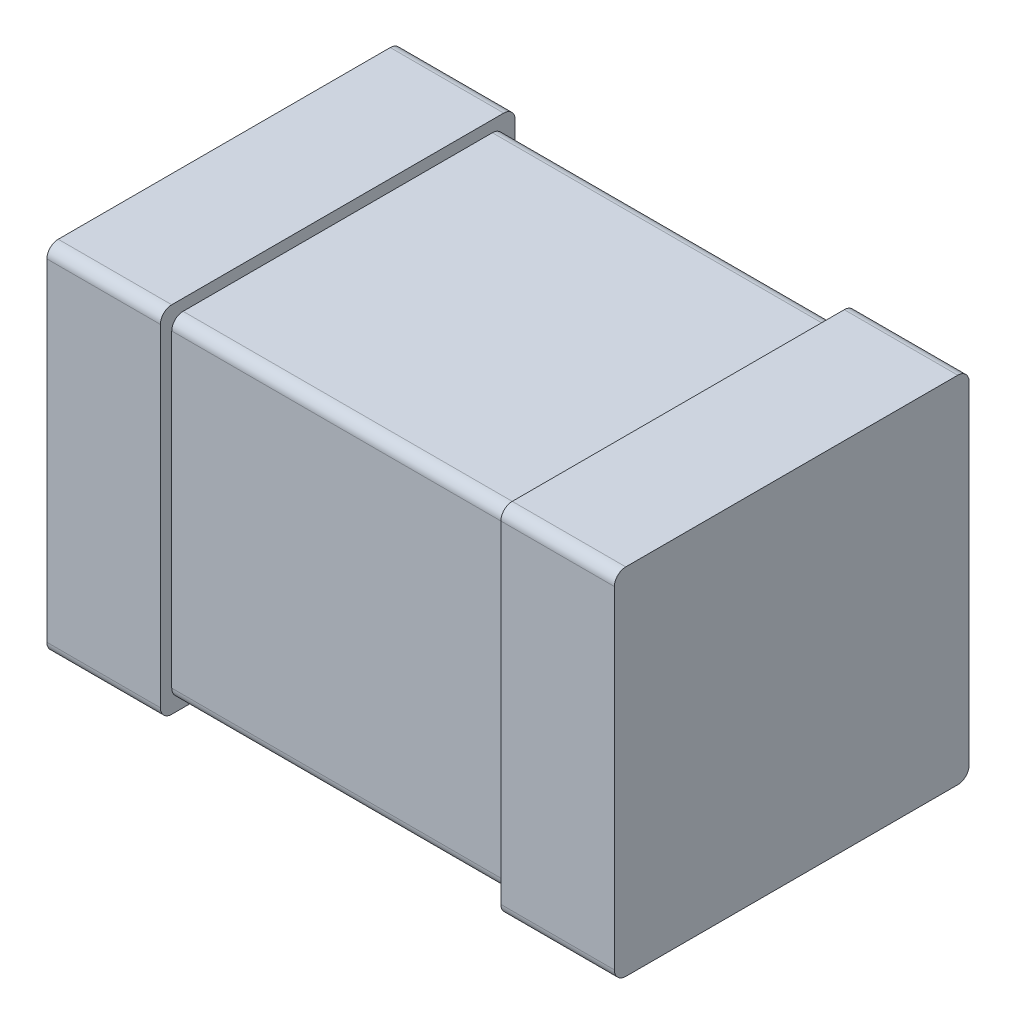
ISO-10303-21;
HEADER;
FILE_DESCRIPTION(('STEP AP214'),'2;1');
FILE_NAME('part.step','',(''),(''),'','','');
FILE_SCHEMA(('AUTOMOTIVE_DESIGN { 1 0 10303 214 1 1 1 1 }'));
ENDSEC;
DATA;
#1=APPLICATION_CONTEXT('core data for automotive mechanical design processes');
#2=APPLICATION_PROTOCOL_DEFINITION('international standard','automotive_design',2000,#1);
#3=PRODUCT_CONTEXT('',#1,'mechanical');
#4=PRODUCT('Part','Part','',(#3));
#5=PRODUCT_RELATED_PRODUCT_CATEGORY('part','',(#4));
#6=PRODUCT_DEFINITION_FORMATION('','',#4);
#7=PRODUCT_DEFINITION_CONTEXT('part definition',#1,'design');
#8=PRODUCT_DEFINITION('design','',#6,#7);
#9=PRODUCT_DEFINITION_SHAPE('','',#8);
#10=(LENGTH_UNIT() NAMED_UNIT(*) SI_UNIT(.MILLI.,.METRE.));
#11=(NAMED_UNIT(*) PLANE_ANGLE_UNIT() SI_UNIT($,.RADIAN.));
#12=(NAMED_UNIT(*) SI_UNIT($,.STERADIAN.) SOLID_ANGLE_UNIT());
#13=UNCERTAINTY_MEASURE_WITH_UNIT(LENGTH_MEASURE(1.E-05),#10,'distance_accuracy_value','');
#14=(GEOMETRIC_REPRESENTATION_CONTEXT(3) GLOBAL_UNCERTAINTY_ASSIGNED_CONTEXT((#13)) GLOBAL_UNIT_ASSIGNED_CONTEXT((#10,
#11,#12)) REPRESENTATION_CONTEXT('',''));
#15=CARTESIAN_POINT('',(0.,0.,0.));
#16=DIRECTION('',(0.,0.,1.));
#17=DIRECTION('',(1.,0.,0.));
#18=AXIS2_PLACEMENT_3D('',#15,#16,#17);
#19=CARTESIAN_POINT('',(1.,-0.625,0.));
#20=DIRECTION('',(1.,0.,0.));
#21=DIRECTION('',(0.,1.,0.));
#22=AXIS2_PLACEMENT_3D('',#19,#20,#21);
#23=PLANE('',#22);
#24=DIRECTION('',(0.,0.,1.));
#25=VECTOR('',#24,1.);
#26=CARTESIAN_POINT('',(1.,-0.625,0.));
#27=LINE('',#26,#25);
#28=CARTESIAN_POINT('',(1.,-0.625,0.04));
#29=VERTEX_POINT('',#28);
#30=CARTESIAN_POINT('',(1.,-0.625,1.21));
#31=VERTEX_POINT('',#30);
#32=EDGE_CURVE('E439',#29,#31,#27,.T.);
#33=ORIENTED_EDGE('',*,*,#32,.F.);
#34=CARTESIAN_POINT('',(1.,-0.585,0.04));
#35=DIRECTION('',(1.,0.,0.));
#36=DIRECTION('',(0.,0.,1.));
#37=AXIS2_PLACEMENT_3D('',#34,#35,#36);
#38=CIRCLE('',#37,0.04);
#39=CARTESIAN_POINT('',(1.,-0.585,0.));
#40=VERTEX_POINT('',#39);
#41=EDGE_CURVE('E250',#29,#40,#38,.T.);
#42=ORIENTED_EDGE('',*,*,#41,.T.);
#43=DIRECTION('',(0.,1.,0.));
#44=VECTOR('',#43,1.);
#45=CARTESIAN_POINT('',(1.,-0.625,0.));
#46=LINE('',#45,#44);
#47=CARTESIAN_POINT('',(1.,0.585,0.));
#48=VERTEX_POINT('',#47);
#49=EDGE_CURVE('E237',#40,#48,#46,.T.);
#50=ORIENTED_EDGE('',*,*,#49,.T.);
#51=CARTESIAN_POINT('',(1.,0.585,0.04));
#52=DIRECTION('',(-1.,0.,0.));
#53=DIRECTION('',(0.,0.,1.));
#54=AXIS2_PLACEMENT_3D('',#51,#52,#53);
#55=CIRCLE('',#54,0.04);
#56=CARTESIAN_POINT('',(1.,0.625,0.04));
#57=VERTEX_POINT('',#56);
#58=EDGE_CURVE('E289',#57,#48,#55,.T.);
#59=ORIENTED_EDGE('',*,*,#58,.F.);
#60=DIRECTION('',(0.,0.,1.));
#61=VECTOR('',#60,1.);
#62=CARTESIAN_POINT('',(1.,0.625,0.));
#63=LINE('',#62,#61);
#64=CARTESIAN_POINT('',(1.,0.625,1.21));
#65=VERTEX_POINT('',#64);
#66=EDGE_CURVE('E11',#57,#65,#63,.T.);
#67=ORIENTED_EDGE('',*,*,#66,.T.);
#68=CARTESIAN_POINT('',(1.,0.585,1.21));
#69=DIRECTION('',(1.,0.,0.));
#70=DIRECTION('',(0.,0.,1.));
#71=AXIS2_PLACEMENT_3D('',#68,#69,#70);
#72=CIRCLE('',#71,0.04);
#73=CARTESIAN_POINT('',(1.,0.585,1.25));
#74=VERTEX_POINT('',#73);
#75=EDGE_CURVE('E235',#65,#74,#72,.T.);
#76=ORIENTED_EDGE('',*,*,#75,.T.);
#77=DIRECTION('',(0.,1.,0.));
#78=VECTOR('',#77,1.);
#79=CARTESIAN_POINT('',(1.,-0.625,1.25));
#80=LINE('',#79,#78);
#81=CARTESIAN_POINT('',(1.,-0.585,1.25));
#82=VERTEX_POINT('',#81);
#83=EDGE_CURVE('E230',#82,#74,#80,.T.);
#84=ORIENTED_EDGE('',*,*,#83,.F.);
#85=CARTESIAN_POINT('',(1.,-0.585,1.21));
#86=DIRECTION('',(-1.,0.,0.));
#87=DIRECTION('',(0.,0.,1.));
#88=AXIS2_PLACEMENT_3D('',#85,#86,#87);
#89=CIRCLE('',#88,0.04);
#90=EDGE_CURVE('E232',#31,#82,#89,.T.);
#91=ORIENTED_EDGE('',*,*,#90,.F.);
#92=EDGE_LOOP('',(#33,#42,#50,#59,#67,#76,#84,#91));
#93=FACE_BOUND('',#92,.T.);
#94=ADVANCED_FACE('F19',(#93),#23,.T.);
#95=CARTESIAN_POINT('',(0.6,0.625,0.));
#96=DIRECTION('',(0.,1.,0.));
#97=DIRECTION('',(1.,0.,0.));
#98=AXIS2_PLACEMENT_3D('',#95,#96,#97);
#99=PLANE('',#98);
#100=ORIENTED_EDGE('',*,*,#66,.F.);
#101=DIRECTION('',(1.,0.,0.));
#102=VECTOR('',#101,1.);
#103=CARTESIAN_POINT('',(0.6,0.625,0.04));
#104=LINE('',#103,#102);
#105=CARTESIAN_POINT('',(0.6,0.625,0.04));
#106=VERTEX_POINT('',#105);
#107=EDGE_CURVE('E292',#106,#57,#104,.T.);
#108=ORIENTED_EDGE('',*,*,#107,.F.);
#109=DIRECTION('',(0.,0.,1.));
#110=VECTOR('',#109,1.);
#111=CARTESIAN_POINT('',(0.6,0.625,0.));
#112=LINE('',#111,#110);
#113=CARTESIAN_POINT('',(0.6,0.625,1.21));
#114=VERTEX_POINT('',#113);
#115=EDGE_CURVE('E269',#106,#114,#112,.T.);
#116=ORIENTED_EDGE('',*,*,#115,.T.);
#117=DIRECTION('',(1.,0.,0.));
#118=VECTOR('',#117,1.);
#119=CARTESIAN_POINT('',(0.6,0.625,1.21));
#120=LINE('',#119,#118);
#121=EDGE_CURVE('E30',#114,#65,#120,.T.);
#122=ORIENTED_EDGE('',*,*,#121,.T.);
#123=EDGE_LOOP('',(#100,#108,#116,#122));
#124=FACE_BOUND('',#123,.T.);
#125=ADVANCED_FACE('F888',(#124),#99,.T.);
#126=CARTESIAN_POINT('',(0.6,0.585,1.21));
#127=DIRECTION('',(1.,0.,0.));
#128=DIRECTION('',(0.,1.,0.));
#129=AXIS2_PLACEMENT_3D('',#126,#127,#128);
#130=CYLINDRICAL_SURFACE('',#129,0.04);
#131=CARTESIAN_POINT('',(0.6,0.585,1.21));
#132=DIRECTION('',(1.,0.,0.));
#133=DIRECTION('',(0.,0.,1.));
#134=AXIS2_PLACEMENT_3D('',#131,#132,#133);
#135=CIRCLE('',#134,0.04);
#136=CARTESIAN_POINT('',(0.6,0.585,1.25));
#137=VERTEX_POINT('',#136);
#138=EDGE_CURVE('E262',#114,#137,#135,.T.);
#139=ORIENTED_EDGE('',*,*,#138,.T.);
#140=DIRECTION('',(1.,0.,0.));
#141=VECTOR('',#140,1.);
#142=CARTESIAN_POINT('',(0.6,0.585,1.25));
#143=LINE('',#142,#141);
#144=EDGE_CURVE('E208',#137,#74,#143,.T.);
#145=ORIENTED_EDGE('',*,*,#144,.T.);
#146=ORIENTED_EDGE('',*,*,#75,.F.);
#147=ORIENTED_EDGE('',*,*,#121,.F.);
#148=EDGE_LOOP('',(#139,#145,#146,#147));
#149=FACE_BOUND('',#148,.T.);
#150=ADVANCED_FACE('F879',(#149),#130,.T.);
#151=CARTESIAN_POINT('',(0.6,0.585,0.04));
#152=DIRECTION('',(1.,0.,0.));
#153=DIRECTION('',(0.,1.,0.));
#154=AXIS2_PLACEMENT_3D('',#151,#152,#153);
#155=CYLINDRICAL_SURFACE('',#154,0.04);
#156=ORIENTED_EDGE('',*,*,#107,.T.);
#157=ORIENTED_EDGE('',*,*,#58,.T.);
#158=DIRECTION('',(1.,0.,0.));
#159=VECTOR('',#158,1.);
#160=CARTESIAN_POINT('',(0.6,0.585,0.));
#161=LINE('',#160,#159);
#162=CARTESIAN_POINT('',(0.6,0.585,0.));
#163=VERTEX_POINT('',#162);
#164=EDGE_CURVE('E244',#163,#48,#161,.T.);
#165=ORIENTED_EDGE('',*,*,#164,.F.);
#166=CARTESIAN_POINT('',(0.6,0.585,0.04));
#167=DIRECTION('',(-1.,0.,0.));
#168=DIRECTION('',(0.,0.,1.));
#169=AXIS2_PLACEMENT_3D('',#166,#167,#168);
#170=CIRCLE('',#169,0.04);
#171=EDGE_CURVE('E285',#106,#163,#170,.T.);
#172=ORIENTED_EDGE('',*,*,#171,.F.);
#173=EDGE_LOOP('',(#156,#157,#165,#172));
#174=FACE_BOUND('',#173,.T.);
#175=ADVANCED_FACE('F776',(#174),#155,.T.);
#176=CARTESIAN_POINT('',(0.6,-0.625,1.25));
#177=DIRECTION('',(0.,0.,1.));
#178=DIRECTION('',(1.,0.,0.));
#179=AXIS2_PLACEMENT_3D('',#176,#177,#178);
#180=PLANE('',#179);
#181=DIRECTION('',(0.,1.,0.));
#182=VECTOR('',#181,1.);
#183=CARTESIAN_POINT('',(0.6,-0.625,1.25));
#184=LINE('',#183,#182);
#185=CARTESIAN_POINT('',(0.6,-0.585,1.25));
#186=VERTEX_POINT('',#185);
#187=EDGE_CURVE('E241',#186,#137,#184,.T.);
#188=ORIENTED_EDGE('',*,*,#187,.F.);
#189=DIRECTION('',(1.,0.,0.));
#190=VECTOR('',#189,1.);
#191=CARTESIAN_POINT('',(0.6,-0.585,1.25));
#192=LINE('',#191,#190);
#193=EDGE_CURVE('E197',#186,#82,#192,.T.);
#194=ORIENTED_EDGE('',*,*,#193,.T.);
#195=ORIENTED_EDGE('',*,*,#83,.T.);
#196=ORIENTED_EDGE('',*,*,#144,.F.);
#197=EDGE_LOOP('',(#188,#194,#195,#196));
#198=FACE_BOUND('',#197,.T.);
#199=ADVANCED_FACE('F239',(#198),#180,.T.);
#200=CARTESIAN_POINT('',(0.6,-0.625,0.));
#201=DIRECTION('',(0.,0.,1.));
#202=DIRECTION('',(1.,0.,0.));
#203=AXIS2_PLACEMENT_3D('',#200,#201,#202);
#204=PLANE('',#203);
#205=ORIENTED_EDGE('',*,*,#164,.T.);
#206=ORIENTED_EDGE('',*,*,#49,.F.);
#207=DIRECTION('',(1.,0.,0.));
#208=VECTOR('',#207,1.);
#209=CARTESIAN_POINT('',(0.6,-0.585,0.));
#210=LINE('',#209,#208);
#211=CARTESIAN_POINT('',(0.6,-0.585,0.));
#212=VERTEX_POINT('',#211);
#213=EDGE_CURVE('E257',#212,#40,#210,.T.);
#214=ORIENTED_EDGE('',*,*,#213,.F.);
#215=DIRECTION('',(0.,1.,0.));
#216=VECTOR('',#215,1.);
#217=CARTESIAN_POINT('',(0.6,-0.625,0.));
#218=LINE('',#217,#216);
#219=EDGE_CURVE('E288',#212,#163,#218,.T.);
#220=ORIENTED_EDGE('',*,*,#219,.T.);
#221=EDGE_LOOP('',(#205,#206,#214,#220));
#222=FACE_BOUND('',#221,.T.);
#223=ADVANCED_FACE('F775',(#222),#204,.F.);
#224=CARTESIAN_POINT('',(0.6,-0.585,1.21));
#225=DIRECTION('',(1.,0.,0.));
#226=DIRECTION('',(0.,-1.,0.));
#227=AXIS2_PLACEMENT_3D('',#224,#225,#226);
#228=CYLINDRICAL_SURFACE('',#227,0.04);
#229=DIRECTION('',(1.,0.,0.));
#230=VECTOR('',#229,1.);
#231=CARTESIAN_POINT('',(0.6,-0.625,1.21));
#232=LINE('',#231,#230);
#233=CARTESIAN_POINT('',(0.6,-0.625,1.21));
#234=VERTEX_POINT('',#233);
#235=EDGE_CURVE('E248',#234,#31,#232,.T.);
#236=ORIENTED_EDGE('',*,*,#235,.T.);
#237=ORIENTED_EDGE('',*,*,#90,.T.);
#238=ORIENTED_EDGE('',*,*,#193,.F.);
#239=CARTESIAN_POINT('',(0.6,-0.585,1.21));
#240=DIRECTION('',(-1.,0.,0.));
#241=DIRECTION('',(0.,0.,1.));
#242=AXIS2_PLACEMENT_3D('',#239,#240,#241);
#243=CIRCLE('',#242,0.04);
#244=EDGE_CURVE('E263',#234,#186,#243,.T.);
#245=ORIENTED_EDGE('',*,*,#244,.F.);
#246=EDGE_LOOP('',(#236,#237,#238,#245));
#247=FACE_BOUND('',#246,.T.);
#248=ADVANCED_FACE('F247',(#247),#228,.T.);
#249=CARTESIAN_POINT('',(0.6,-0.585,0.04));
#250=DIRECTION('',(1.,0.,0.));
#251=DIRECTION('',(0.,-1.,0.));
#252=AXIS2_PLACEMENT_3D('',#249,#250,#251);
#253=CYLINDRICAL_SURFACE('',#252,0.04);
#254=CARTESIAN_POINT('',(0.6,-0.585,0.04));
#255=DIRECTION('',(1.,0.,0.));
#256=DIRECTION('',(0.,0.,1.));
#257=AXIS2_PLACEMENT_3D('',#254,#255,#256);
#258=CIRCLE('',#257,0.04);
#259=CARTESIAN_POINT('',(0.6,-0.625,0.04));
#260=VERTEX_POINT('',#259);
#261=EDGE_CURVE('E313',#260,#212,#258,.T.);
#262=ORIENTED_EDGE('',*,*,#261,.T.);
#263=ORIENTED_EDGE('',*,*,#213,.T.);
#264=ORIENTED_EDGE('',*,*,#41,.F.);
#265=DIRECTION('',(1.,0.,0.));
#266=VECTOR('',#265,1.);
#267=CARTESIAN_POINT('',(0.6,-0.625,0.04));
#268=LINE('',#267,#266);
#269=EDGE_CURVE('E355',#260,#29,#268,.T.);
#270=ORIENTED_EDGE('',*,*,#269,.F.);
#271=EDGE_LOOP('',(#262,#263,#264,#270));
#272=FACE_BOUND('',#271,.T.);
#273=ADVANCED_FACE('F838',(#272),#253,.T.);
#274=CARTESIAN_POINT('',(0.6,-0.625,0.));
#275=DIRECTION('',(0.,1.,0.));
#276=DIRECTION('',(1.,0.,0.));
#277=AXIS2_PLACEMENT_3D('',#274,#275,#276);
#278=PLANE('',#277);
#279=ORIENTED_EDGE('',*,*,#235,.F.);
#280=DIRECTION('',(0.,0.,1.));
#281=VECTOR('',#280,1.);
#282=CARTESIAN_POINT('',(0.6,-0.625,0.));
#283=LINE('',#282,#281);
#284=EDGE_CURVE('E310',#260,#234,#283,.T.);
#285=ORIENTED_EDGE('',*,*,#284,.F.);
#286=ORIENTED_EDGE('',*,*,#269,.T.);
#287=ORIENTED_EDGE('',*,*,#32,.T.);
#288=EDGE_LOOP('',(#279,#285,#286,#287));
#289=FACE_BOUND('',#288,.T.);
#290=ADVANCED_FACE('F764',(#289),#278,.F.);
#291=CARTESIAN_POINT('',(0.6,-0.625,0.));
#292=DIRECTION('',(1.,0.,0.));
#293=DIRECTION('',(0.,1.,0.));
#294=AXIS2_PLACEMENT_3D('',#291,#292,#293);
#295=PLANE('',#294);
#296=DIRECTION('',(0.,1.,0.));
#297=VECTOR('',#296,1.);
#298=CARTESIAN_POINT('',(0.6,-0.585,0.04));
#299=LINE('',#298,#297);
#300=CARTESIAN_POINT('',(0.6,-0.545,0.04));
#301=VERTEX_POINT('',#300);
#302=CARTESIAN_POINT('',(0.6,0.545,0.04));
#303=VERTEX_POINT('',#302);
#304=EDGE_CURVE('E320',#301,#303,#299,.T.);
#305=ORIENTED_EDGE('',*,*,#304,.T.);
#306=CARTESIAN_POINT('',(0.6,0.545,0.08));
#307=DIRECTION('',(-1.,0.,0.));
#308=DIRECTION('',(0.,0.,1.));
#309=AXIS2_PLACEMENT_3D('',#306,#307,#308);
#310=CIRCLE('',#309,0.04);
#311=CARTESIAN_POINT('',(0.6,0.585,0.08));
#312=VERTEX_POINT('',#311);
#313=EDGE_CURVE('E283',#312,#303,#310,.T.);
#314=ORIENTED_EDGE('',*,*,#313,.F.);
#315=DIRECTION('',(0.,0.,1.));
#316=VECTOR('',#315,1.);
#317=CARTESIAN_POINT('',(0.6,0.585,0.04));
#318=LINE('',#317,#316);
#319=CARTESIAN_POINT('',(0.6,0.585,1.17));
#320=VERTEX_POINT('',#319);
#321=EDGE_CURVE('E330',#312,#320,#318,.T.);
#322=ORIENTED_EDGE('',*,*,#321,.T.);
#323=CARTESIAN_POINT('',(0.6,0.545,1.17));
#324=DIRECTION('',(1.,0.,0.));
#325=DIRECTION('',(0.,0.,1.));
#326=AXIS2_PLACEMENT_3D('',#323,#324,#325);
#327=CIRCLE('',#326,0.04);
#328=CARTESIAN_POINT('',(0.6,0.545,1.21));
#329=VERTEX_POINT('',#328);
#330=EDGE_CURVE('E304',#320,#329,#327,.T.);
#331=ORIENTED_EDGE('',*,*,#330,.T.);
#332=DIRECTION('',(0.,1.,0.));
#333=VECTOR('',#332,1.);
#334=CARTESIAN_POINT('',(0.6,-0.585,1.21));
#335=LINE('',#334,#333);
#336=CARTESIAN_POINT('',(0.6,-0.545,1.21));
#337=VERTEX_POINT('',#336);
#338=EDGE_CURVE('E318',#337,#329,#335,.T.);
#339=ORIENTED_EDGE('',*,*,#338,.F.);
#340=CARTESIAN_POINT('',(0.6,-0.545,1.17));
#341=DIRECTION('',(-1.,0.,0.));
#342=DIRECTION('',(0.,0.,1.));
#343=AXIS2_PLACEMENT_3D('',#340,#341,#342);
#344=CIRCLE('',#343,0.04);
#345=CARTESIAN_POINT('',(0.6,-0.585,1.17));
#346=VERTEX_POINT('',#345);
#347=EDGE_CURVE('E279',#346,#337,#344,.T.);
#348=ORIENTED_EDGE('',*,*,#347,.F.);
#349=DIRECTION('',(0.,0.,1.));
#350=VECTOR('',#349,1.);
#351=CARTESIAN_POINT('',(0.6,-0.585,0.04));
#352=LINE('',#351,#350);
#353=CARTESIAN_POINT('',(0.6,-0.585,0.08));
#354=VERTEX_POINT('',#353);
#355=EDGE_CURVE('E272',#354,#346,#352,.T.);
#356=ORIENTED_EDGE('',*,*,#355,.F.);
#357=CARTESIAN_POINT('',(0.6,-0.545,0.08));
#358=DIRECTION('',(1.,0.,0.));
#359=DIRECTION('',(0.,0.,1.));
#360=AXIS2_PLACEMENT_3D('',#357,#358,#359);
#361=CIRCLE('',#360,0.04);
#362=EDGE_CURVE('E408',#354,#301,#361,.T.);
#363=ORIENTED_EDGE('',*,*,#362,.T.);
#364=EDGE_LOOP('',(#305,#314,#322,#331,#339,#348,#356,#363));
#365=FACE_BOUND('',#364,.T.);
#366=ORIENTED_EDGE('',*,*,#244,.T.);
#367=ORIENTED_EDGE('',*,*,#187,.T.);
#368=ORIENTED_EDGE('',*,*,#138,.F.);
#369=ORIENTED_EDGE('',*,*,#115,.F.);
#370=ORIENTED_EDGE('',*,*,#171,.T.);
#371=ORIENTED_EDGE('',*,*,#219,.F.);
#372=ORIENTED_EDGE('',*,*,#261,.F.);
#373=ORIENTED_EDGE('',*,*,#284,.T.);
#374=EDGE_LOOP('',(#366,#367,#368,#369,#370,#371,#372,#373));
#375=FACE_BOUND('',#374,.T.);
#376=ADVANCED_FACE('F599',(#365,#375),#295,.F.);
#377=CARTESIAN_POINT('',(-0.6,-0.585,0.04));
#378=DIRECTION('',(0.,1.,0.));
#379=DIRECTION('',(1.,0.,0.));
#380=AXIS2_PLACEMENT_3D('',#377,#378,#379);
#381=PLANE('',#380);
#382=DIRECTION('',(1.,0.,0.));
#383=VECTOR('',#382,1.);
#384=CARTESIAN_POINT('',(-0.6,-0.585,1.17));
#385=LINE('',#384,#383);
#386=CARTESIAN_POINT('',(-0.6,-0.585,1.17));
#387=VERTEX_POINT('',#386);
#388=EDGE_CURVE('E358',#387,#346,#385,.T.);
#389=ORIENTED_EDGE('',*,*,#388,.F.);
#390=DIRECTION('',(0.,0.,1.));
#391=VECTOR('',#390,1.);
#392=CARTESIAN_POINT('',(-0.6,-0.585,0.04));
#393=LINE('',#392,#391);
#394=CARTESIAN_POINT('',(-0.6,-0.585,0.08));
#395=VERTEX_POINT('',#394);
#396=EDGE_CURVE('E369',#395,#387,#393,.T.);
#397=ORIENTED_EDGE('',*,*,#396,.F.);
#398=DIRECTION('',(1.,0.,0.));
#399=VECTOR('',#398,1.);
#400=CARTESIAN_POINT('',(-0.6,-0.585,0.08));
#401=LINE('',#400,#399);
#402=EDGE_CURVE('E412',#395,#354,#401,.T.);
#403=ORIENTED_EDGE('',*,*,#402,.T.);
#404=ORIENTED_EDGE('',*,*,#355,.T.);
#405=EDGE_LOOP('',(#389,#397,#403,#404));
#406=FACE_BOUND('',#405,.T.);
#407=ADVANCED_FACE('F593',(#406),#381,.F.);
#408=CARTESIAN_POINT('',(-0.6,-0.545,1.17));
#409=DIRECTION('',(1.,0.,0.));
#410=DIRECTION('',(0.,-1.,0.));
#411=AXIS2_PLACEMENT_3D('',#408,#409,#410);
#412=CYLINDRICAL_SURFACE('',#411,0.04);
#413=ORIENTED_EDGE('',*,*,#388,.T.);
#414=ORIENTED_EDGE('',*,*,#347,.T.);
#415=DIRECTION('',(1.,0.,0.));
#416=VECTOR('',#415,1.);
#417=CARTESIAN_POINT('',(-0.6,-0.545,1.21));
#418=LINE('',#417,#416);
#419=CARTESIAN_POINT('',(-0.6,-0.545,1.21));
#420=VERTEX_POINT('',#419);
#421=EDGE_CURVE('E308',#420,#337,#418,.T.);
#422=ORIENTED_EDGE('',*,*,#421,.F.);
#423=CARTESIAN_POINT('',(-0.6,-0.545,1.17));
#424=DIRECTION('',(-1.,0.,0.));
#425=DIRECTION('',(0.,0.,1.));
#426=AXIS2_PLACEMENT_3D('',#423,#424,#425);
#427=CIRCLE('',#426,0.04);
#428=EDGE_CURVE('E347',#387,#420,#427,.T.);
#429=ORIENTED_EDGE('',*,*,#428,.F.);
#430=EDGE_LOOP('',(#413,#414,#422,#429));
#431=FACE_BOUND('',#430,.T.);
#432=ADVANCED_FACE('F598',(#431),#412,.T.);
#433=CARTESIAN_POINT('',(-0.6,-0.585,1.21));
#434=DIRECTION('',(0.,0.,1.));
#435=DIRECTION('',(1.,0.,0.));
#436=AXIS2_PLACEMENT_3D('',#433,#434,#435);
#437=PLANE('',#436);
#438=DIRECTION('',(0.,1.,0.));
#439=VECTOR('',#438,1.);
#440=CARTESIAN_POINT('',(-0.6,-0.585,1.21));
#441=LINE('',#440,#439);
#442=CARTESIAN_POINT('',(-0.6,0.545,1.21));
#443=VERTEX_POINT('',#442);
#444=EDGE_CURVE('E342',#420,#443,#441,.T.);
#445=ORIENTED_EDGE('',*,*,#444,.F.);
#446=ORIENTED_EDGE('',*,*,#421,.T.);
#447=ORIENTED_EDGE('',*,*,#338,.T.);
#448=DIRECTION('',(1.,0.,0.));
#449=VECTOR('',#448,1.);
#450=CARTESIAN_POINT('',(-0.6,0.545,1.21));
#451=LINE('',#450,#449);
#452=EDGE_CURVE('E309',#443,#329,#451,.T.);
#453=ORIENTED_EDGE('',*,*,#452,.F.);
#454=EDGE_LOOP('',(#445,#446,#447,#453));
#455=FACE_BOUND('',#454,.T.);
#456=ADVANCED_FACE('F614',(#455),#437,.T.);
#457=CARTESIAN_POINT('',(-0.6,0.545,1.17));
#458=DIRECTION('',(1.,0.,0.));
#459=DIRECTION('',(0.,1.,0.));
#460=AXIS2_PLACEMENT_3D('',#457,#458,#459);
#461=CYLINDRICAL_SURFACE('',#460,0.04);
#462=CARTESIAN_POINT('',(-0.6,0.545,1.17));
#463=DIRECTION('',(1.,0.,0.));
#464=DIRECTION('',(0.,0.,1.));
#465=AXIS2_PLACEMENT_3D('',#462,#463,#464);
#466=CIRCLE('',#465,0.04);
#467=CARTESIAN_POINT('',(-0.6,0.585,1.17));
#468=VERTEX_POINT('',#467);
#469=EDGE_CURVE('E346',#468,#443,#466,.T.);
#470=ORIENTED_EDGE('',*,*,#469,.T.);
#471=ORIENTED_EDGE('',*,*,#452,.T.);
#472=ORIENTED_EDGE('',*,*,#330,.F.);
#473=DIRECTION('',(1.,0.,0.));
#474=VECTOR('',#473,1.);
#475=CARTESIAN_POINT('',(-0.6,0.585,1.17));
#476=LINE('',#475,#474);
#477=EDGE_CURVE('E326',#468,#320,#476,.T.);
#478=ORIENTED_EDGE('',*,*,#477,.F.);
#479=EDGE_LOOP('',(#470,#471,#472,#478));
#480=FACE_BOUND('',#479,.T.);
#481=ADVANCED_FACE('F624',(#480),#461,.T.);
#482=CARTESIAN_POINT('',(-0.6,0.585,0.04));
#483=DIRECTION('',(0.,1.,0.));
#484=DIRECTION('',(1.,0.,0.));
#485=AXIS2_PLACEMENT_3D('',#482,#483,#484);
#486=PLANE('',#485);
#487=ORIENTED_EDGE('',*,*,#321,.F.);
#488=DIRECTION('',(1.,0.,0.));
#489=VECTOR('',#488,1.);
#490=CARTESIAN_POINT('',(-0.6,0.585,0.08));
#491=LINE('',#490,#489);
#492=CARTESIAN_POINT('',(-0.6,0.585,0.08));
#493=VERTEX_POINT('',#492);
#494=EDGE_CURVE('E324',#493,#312,#491,.T.);
#495=ORIENTED_EDGE('',*,*,#494,.F.);
#496=DIRECTION('',(0.,0.,1.));
#497=VECTOR('',#496,1.);
#498=CARTESIAN_POINT('',(-0.6,0.585,0.04));
#499=LINE('',#498,#497);
#500=EDGE_CURVE('E482',#493,#468,#499,.T.);
#501=ORIENTED_EDGE('',*,*,#500,.T.);
#502=ORIENTED_EDGE('',*,*,#477,.T.);
#503=EDGE_LOOP('',(#487,#495,#501,#502));
#504=FACE_BOUND('',#503,.T.);
#505=ADVANCED_FACE('F634',(#504),#486,.T.);
#506=CARTESIAN_POINT('',(-0.6,0.545,0.08));
#507=DIRECTION('',(1.,0.,0.));
#508=DIRECTION('',(0.,1.,0.));
#509=AXIS2_PLACEMENT_3D('',#506,#507,#508);
#510=CYLINDRICAL_SURFACE('',#509,0.04);
#511=ORIENTED_EDGE('',*,*,#494,.T.);
#512=ORIENTED_EDGE('',*,*,#313,.T.);
#513=DIRECTION('',(1.,0.,0.));
#514=VECTOR('',#513,1.);
#515=CARTESIAN_POINT('',(-0.6,0.545,0.04));
#516=LINE('',#515,#514);
#517=CARTESIAN_POINT('',(-0.6,0.545,0.04));
#518=VERTEX_POINT('',#517);
#519=EDGE_CURVE('E325',#518,#303,#516,.T.);
#520=ORIENTED_EDGE('',*,*,#519,.F.);
#521=CARTESIAN_POINT('',(-0.6,0.545,0.08));
#522=DIRECTION('',(-1.,0.,0.));
#523=DIRECTION('',(0.,0.,1.));
#524=AXIS2_PLACEMENT_3D('',#521,#522,#523);
#525=CIRCLE('',#524,0.04);
#526=EDGE_CURVE('E477',#493,#518,#525,.T.);
#527=ORIENTED_EDGE('',*,*,#526,.F.);
#528=EDGE_LOOP('',(#511,#512,#520,#527));
#529=FACE_BOUND('',#528,.T.);
#530=ADVANCED_FACE('F644',(#529),#510,.T.);
#531=CARTESIAN_POINT('',(-0.6,-0.585,0.04));
#532=DIRECTION('',(0.,0.,1.));
#533=DIRECTION('',(1.,0.,0.));
#534=AXIS2_PLACEMENT_3D('',#531,#532,#533);
#535=PLANE('',#534);
#536=ORIENTED_EDGE('',*,*,#519,.T.);
#537=ORIENTED_EDGE('',*,*,#304,.F.);
#538=DIRECTION('',(1.,0.,0.));
#539=VECTOR('',#538,1.);
#540=CARTESIAN_POINT('',(-0.6,-0.545,0.04));
#541=LINE('',#540,#539);
#542=CARTESIAN_POINT('',(-0.6,-0.545,0.04));
#543=VERTEX_POINT('',#542);
#544=EDGE_CURVE('E413',#543,#301,#541,.T.);
#545=ORIENTED_EDGE('',*,*,#544,.F.);
#546=DIRECTION('',(0.,1.,0.));
#547=VECTOR('',#546,1.);
#548=CARTESIAN_POINT('',(-0.6,-0.585,0.04));
#549=LINE('',#548,#547);
#550=EDGE_CURVE('E481',#543,#518,#549,.T.);
#551=ORIENTED_EDGE('',*,*,#550,.T.);
#552=EDGE_LOOP('',(#536,#537,#545,#551));
#553=FACE_BOUND('',#552,.T.);
#554=ADVANCED_FACE('F654',(#553),#535,.F.);
#555=CARTESIAN_POINT('',(-0.6,-0.545,0.08));
#556=DIRECTION('',(1.,0.,0.));
#557=DIRECTION('',(0.,-1.,0.));
#558=AXIS2_PLACEMENT_3D('',#555,#556,#557);
#559=CYLINDRICAL_SURFACE('',#558,0.04);
#560=CARTESIAN_POINT('',(-0.6,-0.545,0.08));
#561=DIRECTION('',(1.,0.,0.));
#562=DIRECTION('',(0.,0.,1.));
#563=AXIS2_PLACEMENT_3D('',#560,#561,#562);
#564=CIRCLE('',#563,0.04);
#565=EDGE_CURVE('E373',#395,#543,#564,.T.);
#566=ORIENTED_EDGE('',*,*,#565,.T.);
#567=ORIENTED_EDGE('',*,*,#544,.T.);
#568=ORIENTED_EDGE('',*,*,#362,.F.);
#569=ORIENTED_EDGE('',*,*,#402,.F.);
#570=EDGE_LOOP('',(#566,#567,#568,#569));
#571=FACE_BOUND('',#570,.T.);
#572=ADVANCED_FACE('F665',(#571),#559,.T.);
#573=CARTESIAN_POINT('',(-0.6,-0.625,0.));
#574=DIRECTION('',(1.,0.,0.));
#575=DIRECTION('',(0.,1.,0.));
#576=AXIS2_PLACEMENT_3D('',#573,#574,#575);
#577=PLANE('',#576);
#578=ORIENTED_EDGE('',*,*,#565,.F.);
#579=ORIENTED_EDGE('',*,*,#396,.T.);
#580=ORIENTED_EDGE('',*,*,#428,.T.);
#581=ORIENTED_EDGE('',*,*,#444,.T.);
#582=ORIENTED_EDGE('',*,*,#469,.F.);
#583=ORIENTED_EDGE('',*,*,#500,.F.);
#584=ORIENTED_EDGE('',*,*,#526,.T.);
#585=ORIENTED_EDGE('',*,*,#550,.F.);
#586=EDGE_LOOP('',(#578,#579,#580,#581,#582,#583,#584,#585));
#587=FACE_BOUND('',#586,.T.);
#588=DIRECTION('',(0.,0.,1.));
#589=VECTOR('',#588,1.);
#590=CARTESIAN_POINT('',(-0.6,-0.625,0.));
#591=LINE('',#590,#589);
#592=CARTESIAN_POINT('',(-0.6,-0.625,0.04));
#593=VERTEX_POINT('',#592);
#594=CARTESIAN_POINT('',(-0.6,-0.625,1.21));
#595=VERTEX_POINT('',#594);
#596=EDGE_CURVE('E260',#593,#595,#591,.T.);
#597=ORIENTED_EDGE('',*,*,#596,.F.);
#598=CARTESIAN_POINT('',(-0.6,-0.585,0.04));
#599=DIRECTION('',(1.,0.,0.));
#600=DIRECTION('',(0.,0.,1.));
#601=AXIS2_PLACEMENT_3D('',#598,#599,#600);
#602=CIRCLE('',#601,0.04);
#603=CARTESIAN_POINT('',(-0.6,-0.585,0.));
#604=VERTEX_POINT('',#603);
#605=EDGE_CURVE('E384',#593,#604,#602,.T.);
#606=ORIENTED_EDGE('',*,*,#605,.T.);
#607=DIRECTION('',(0.,1.,0.));
#608=VECTOR('',#607,1.);
#609=CARTESIAN_POINT('',(-0.6,-0.625,0.));
#610=LINE('',#609,#608);
#611=CARTESIAN_POINT('',(-0.6,0.585,0.));
#612=VERTEX_POINT('',#611);
#613=EDGE_CURVE('E392',#604,#612,#610,.T.);
#614=ORIENTED_EDGE('',*,*,#613,.T.);
#615=CARTESIAN_POINT('',(-0.6,0.585,0.04));
#616=DIRECTION('',(-1.,0.,0.));
#617=DIRECTION('',(0.,0.,1.));
#618=AXIS2_PLACEMENT_3D('',#615,#616,#617);
#619=CIRCLE('',#618,0.04);
#620=CARTESIAN_POINT('',(-0.6,0.625,0.04));
#621=VERTEX_POINT('',#620);
#622=EDGE_CURVE('E299',#621,#612,#619,.T.);
#623=ORIENTED_EDGE('',*,*,#622,.F.);
#624=DIRECTION('',(0.,0.,1.));
#625=VECTOR('',#624,1.);
#626=CARTESIAN_POINT('',(-0.6,0.625,0.));
#627=LINE('',#626,#625);
#628=CARTESIAN_POINT('',(-0.6,0.625,1.21));
#629=VERTEX_POINT('',#628);
#630=EDGE_CURVE('E396',#621,#629,#627,.T.);
#631=ORIENTED_EDGE('',*,*,#630,.T.);
#632=CARTESIAN_POINT('',(-0.6,0.585,1.21));
#633=DIRECTION('',(1.,0.,0.));
#634=DIRECTION('',(0.,0.,1.));
#635=AXIS2_PLACEMENT_3D('',#632,#633,#634);
#636=CIRCLE('',#635,0.04);
#637=CARTESIAN_POINT('',(-0.6,0.585,1.25));
#638=VERTEX_POINT('',#637);
#639=EDGE_CURVE('E302',#629,#638,#636,.T.);
#640=ORIENTED_EDGE('',*,*,#639,.T.);
#641=DIRECTION('',(0.,1.,0.));
#642=VECTOR('',#641,1.);
#643=CARTESIAN_POINT('',(-0.6,-0.625,1.25));
#644=LINE('',#643,#642);
#645=CARTESIAN_POINT('',(-0.6,-0.585,1.25));
#646=VERTEX_POINT('',#645);
#647=EDGE_CURVE('E469',#646,#638,#644,.T.);
#648=ORIENTED_EDGE('',*,*,#647,.F.);
#649=CARTESIAN_POINT('',(-0.6,-0.585,1.21));
#650=DIRECTION('',(-1.,0.,0.));
#651=DIRECTION('',(0.,0.,1.));
#652=AXIS2_PLACEMENT_3D('',#649,#650,#651);
#653=CIRCLE('',#652,0.04);
#654=EDGE_CURVE('E341',#595,#646,#653,.T.);
#655=ORIENTED_EDGE('',*,*,#654,.F.);
#656=EDGE_LOOP('',(#597,#606,#614,#623,#631,#640,#648,#655));
#657=FACE_BOUND('',#656,.T.);
#658=ADVANCED_FACE('F538',(#587,#657),#577,.T.);
#659=CARTESIAN_POINT('',(-1.,0.625,0.));
#660=DIRECTION('',(0.,1.,0.));
#661=DIRECTION('',(1.,0.,0.));
#662=AXIS2_PLACEMENT_3D('',#659,#660,#661);
#663=PLANE('',#662);
#664=ORIENTED_EDGE('',*,*,#630,.F.);
#665=DIRECTION('',(1.,0.,0.));
#666=VECTOR('',#665,1.);
#667=CARTESIAN_POINT('',(-1.,0.625,0.04));
#668=LINE('',#667,#666);
#669=CARTESIAN_POINT('',(-1.,0.625,0.04));
#670=VERTEX_POINT('',#669);
#671=EDGE_CURVE('E303',#670,#621,#668,.T.);
#672=ORIENTED_EDGE('',*,*,#671,.F.);
#673=DIRECTION('',(0.,0.,1.));
#674=VECTOR('',#673,1.);
#675=CARTESIAN_POINT('',(-1.,0.625,0.));
#676=LINE('',#675,#674);
#677=CARTESIAN_POINT('',(-1.,0.625,1.21));
#678=VERTEX_POINT('',#677);
#679=EDGE_CURVE('E352',#670,#678,#676,.T.);
#680=ORIENTED_EDGE('',*,*,#679,.T.);
#681=DIRECTION('',(1.,0.,0.));
#682=VECTOR('',#681,1.);
#683=CARTESIAN_POINT('',(-1.,0.625,1.21));
#684=LINE('',#683,#682);
#685=EDGE_CURVE('E422',#678,#629,#684,.T.);
#686=ORIENTED_EDGE('',*,*,#685,.T.);
#687=EDGE_LOOP('',(#664,#672,#680,#686));
#688=FACE_BOUND('',#687,.T.);
#689=ADVANCED_FACE('F21',(#688),#663,.T.);
#690=CARTESIAN_POINT('',(-1.,0.585,1.21));
#691=DIRECTION('',(1.,0.,0.));
#692=DIRECTION('',(0.,1.,0.));
#693=AXIS2_PLACEMENT_3D('',#690,#691,#692);
#694=CYLINDRICAL_SURFACE('',#693,0.04);
#695=CARTESIAN_POINT('',(-1.,0.585,1.21));
#696=DIRECTION('',(1.,0.,0.));
#697=DIRECTION('',(0.,0.,1.));
#698=AXIS2_PLACEMENT_3D('',#695,#696,#697);
#699=CIRCLE('',#698,0.04);
#700=CARTESIAN_POINT('',(-1.,0.585,1.25));
#701=VERTEX_POINT('',#700);
#702=EDGE_CURVE('E348',#678,#701,#699,.T.);
#703=ORIENTED_EDGE('',*,*,#702,.T.);
#704=DIRECTION('',(1.,0.,0.));
#705=VECTOR('',#704,1.);
#706=CARTESIAN_POINT('',(-1.,0.585,1.25));
#707=LINE('',#706,#705);
#708=EDGE_CURVE('E380',#701,#638,#707,.T.);
#709=ORIENTED_EDGE('',*,*,#708,.T.);
#710=ORIENTED_EDGE('',*,*,#639,.F.);
#711=ORIENTED_EDGE('',*,*,#685,.F.);
#712=EDGE_LOOP('',(#703,#709,#710,#711));
#713=FACE_BOUND('',#712,.T.);
#714=ADVANCED_FACE('F524',(#713),#694,.T.);
#715=CARTESIAN_POINT('',(-1.,0.585,0.04));
#716=DIRECTION('',(1.,0.,0.));
#717=DIRECTION('',(0.,1.,0.));
#718=AXIS2_PLACEMENT_3D('',#715,#716,#717);
#719=CYLINDRICAL_SURFACE('',#718,0.04);
#720=ORIENTED_EDGE('',*,*,#671,.T.);
#721=ORIENTED_EDGE('',*,*,#622,.T.);
#722=DIRECTION('',(1.,0.,0.));
#723=VECTOR('',#722,1.);
#724=CARTESIAN_POINT('',(-1.,0.585,0.));
#725=LINE('',#724,#723);
#726=CARTESIAN_POINT('',(-1.,0.585,0.));
#727=VERTEX_POINT('',#726);
#728=EDGE_CURVE('E340',#727,#612,#725,.T.);
#729=ORIENTED_EDGE('',*,*,#728,.F.);
#730=CARTESIAN_POINT('',(-1.,0.585,0.04));
#731=DIRECTION('',(-1.,0.,0.));
#732=DIRECTION('',(0.,0.,1.));
#733=AXIS2_PLACEMENT_3D('',#730,#731,#732);
#734=CIRCLE('',#733,0.04);
#735=EDGE_CURVE('E298',#670,#727,#734,.T.);
#736=ORIENTED_EDGE('',*,*,#735,.F.);
#737=EDGE_LOOP('',(#720,#721,#729,#736));
#738=FACE_BOUND('',#737,.T.);
#739=ADVANCED_FACE('F554',(#738),#719,.T.);
#740=CARTESIAN_POINT('',(-1.,-0.625,1.25));
#741=DIRECTION('',(0.,0.,1.));
#742=DIRECTION('',(1.,0.,0.));
#743=AXIS2_PLACEMENT_3D('',#740,#741,#742);
#744=PLANE('',#743);
#745=DIRECTION('',(0.,1.,0.));
#746=VECTOR('',#745,1.);
#747=CARTESIAN_POINT('',(-1.,-0.625,1.25));
#748=LINE('',#747,#746);
#749=CARTESIAN_POINT('',(-1.,-0.585,1.25));
#750=VERTEX_POINT('',#749);
#751=EDGE_CURVE('E23',#750,#701,#748,.T.);
#752=ORIENTED_EDGE('',*,*,#751,.F.);
#753=DIRECTION('',(1.,0.,0.));
#754=VECTOR('',#753,1.);
#755=CARTESIAN_POINT('',(-1.,-0.585,1.25));
#756=LINE('',#755,#754);
#757=EDGE_CURVE('E336',#750,#646,#756,.T.);
#758=ORIENTED_EDGE('',*,*,#757,.T.);
#759=ORIENTED_EDGE('',*,*,#647,.T.);
#760=ORIENTED_EDGE('',*,*,#708,.F.);
#761=EDGE_LOOP('',(#752,#758,#759,#760));
#762=FACE_BOUND('',#761,.T.);
#763=ADVANCED_FACE('F528',(#762),#744,.T.);
#764=CARTESIAN_POINT('',(-1.,-0.625,0.));
#765=DIRECTION('',(0.,0.,1.));
#766=DIRECTION('',(1.,0.,0.));
#767=AXIS2_PLACEMENT_3D('',#764,#765,#766);
#768=PLANE('',#767);
#769=ORIENTED_EDGE('',*,*,#728,.T.);
#770=ORIENTED_EDGE('',*,*,#613,.F.);
#771=DIRECTION('',(1.,0.,0.));
#772=VECTOR('',#771,1.);
#773=CARTESIAN_POINT('',(-1.,-0.585,0.));
#774=LINE('',#773,#772);
#775=CARTESIAN_POINT('',(-1.,-0.585,0.));
#776=VERTEX_POINT('',#775);
#777=EDGE_CURVE('E388',#776,#604,#774,.T.);
#778=ORIENTED_EDGE('',*,*,#777,.F.);
#779=DIRECTION('',(0.,1.,0.));
#780=VECTOR('',#779,1.);
#781=CARTESIAN_POINT('',(-1.,-0.625,0.));
#782=LINE('',#781,#780);
#783=EDGE_CURVE('E293',#776,#727,#782,.T.);
#784=ORIENTED_EDGE('',*,*,#783,.T.);
#785=EDGE_LOOP('',(#769,#770,#778,#784));
#786=FACE_BOUND('',#785,.T.);
#787=ADVANCED_FACE('F551',(#786),#768,.F.);
#788=CARTESIAN_POINT('',(-1.,-0.585,1.21));
#789=DIRECTION('',(1.,0.,0.));
#790=DIRECTION('',(0.,-1.,0.));
#791=AXIS2_PLACEMENT_3D('',#788,#789,#790);
#792=CYLINDRICAL_SURFACE('',#791,0.04);
#793=DIRECTION('',(1.,0.,0.));
#794=VECTOR('',#793,1.);
#795=CARTESIAN_POINT('',(-1.,-0.625,1.21));
#796=LINE('',#795,#794);
#797=CARTESIAN_POINT('',(-1.,-0.625,1.21));
#798=VERTEX_POINT('',#797);
#799=EDGE_CURVE('E335',#798,#595,#796,.T.);
#800=ORIENTED_EDGE('',*,*,#799,.T.);
#801=ORIENTED_EDGE('',*,*,#654,.T.);
#802=ORIENTED_EDGE('',*,*,#757,.F.);
#803=CARTESIAN_POINT('',(-1.,-0.585,1.21));
#804=DIRECTION('',(-1.,0.,0.));
#805=DIRECTION('',(0.,0.,1.));
#806=AXIS2_PLACEMENT_3D('',#803,#804,#805);
#807=CIRCLE('',#806,0.04);
#808=EDGE_CURVE('E365',#798,#750,#807,.T.);
#809=ORIENTED_EDGE('',*,*,#808,.F.);
#810=EDGE_LOOP('',(#800,#801,#802,#809));
#811=FACE_BOUND('',#810,.T.);
#812=ADVANCED_FACE('F535',(#811),#792,.T.);
#813=CARTESIAN_POINT('',(-1.,-0.585,0.04));
#814=DIRECTION('',(1.,0.,0.));
#815=DIRECTION('',(0.,-1.,0.));
#816=AXIS2_PLACEMENT_3D('',#813,#814,#815);
#817=CYLINDRICAL_SURFACE('',#816,0.04);
#818=CARTESIAN_POINT('',(-1.,-0.585,0.04));
#819=DIRECTION('',(1.,0.,0.));
#820=DIRECTION('',(0.,0.,1.));
#821=AXIS2_PLACEMENT_3D('',#818,#819,#820);
#822=CIRCLE('',#821,0.04);
#823=CARTESIAN_POINT('',(-1.,-0.625,0.04));
#824=VERTEX_POINT('',#823);
#825=EDGE_CURVE('E297',#824,#776,#822,.T.);
#826=ORIENTED_EDGE('',*,*,#825,.T.);
#827=ORIENTED_EDGE('',*,*,#777,.T.);
#828=ORIENTED_EDGE('',*,*,#605,.F.);
#829=DIRECTION('',(1.,0.,0.));
#830=VECTOR('',#829,1.);
#831=CARTESIAN_POINT('',(-1.,-0.625,0.04));
#832=LINE('',#831,#830);
#833=EDGE_CURVE('E331',#824,#593,#832,.T.);
#834=ORIENTED_EDGE('',*,*,#833,.F.);
#835=EDGE_LOOP('',(#826,#827,#828,#834));
#836=FACE_BOUND('',#835,.T.);
#837=ADVANCED_FACE('F547',(#836),#817,.T.);
#838=CARTESIAN_POINT('',(-1.,-0.625,0.));
#839=DIRECTION('',(0.,1.,0.));
#840=DIRECTION('',(1.,0.,0.));
#841=AXIS2_PLACEMENT_3D('',#838,#839,#840);
#842=PLANE('',#841);
#843=ORIENTED_EDGE('',*,*,#799,.F.);
#844=DIRECTION('',(0.,0.,1.));
#845=VECTOR('',#844,1.);
#846=CARTESIAN_POINT('',(-1.,-0.625,0.));
#847=LINE('',#846,#845);
#848=EDGE_CURVE('E473',#824,#798,#847,.T.);
#849=ORIENTED_EDGE('',*,*,#848,.F.);
#850=ORIENTED_EDGE('',*,*,#833,.T.);
#851=ORIENTED_EDGE('',*,*,#596,.T.);
#852=EDGE_LOOP('',(#843,#849,#850,#851));
#853=FACE_BOUND('',#852,.T.);
#854=ADVANCED_FACE('F540',(#853),#842,.F.);
#855=CARTESIAN_POINT('',(-1.,-0.625,0.));
#856=DIRECTION('',(1.,0.,0.));
#857=DIRECTION('',(0.,1.,0.));
#858=AXIS2_PLACEMENT_3D('',#855,#856,#857);
#859=PLANE('',#858);
#860=ORIENTED_EDGE('',*,*,#808,.T.);
#861=ORIENTED_EDGE('',*,*,#751,.T.);
#862=ORIENTED_EDGE('',*,*,#702,.F.);
#863=ORIENTED_EDGE('',*,*,#679,.F.);
#864=ORIENTED_EDGE('',*,*,#735,.T.);
#865=ORIENTED_EDGE('',*,*,#783,.F.);
#866=ORIENTED_EDGE('',*,*,#825,.F.);
#867=ORIENTED_EDGE('',*,*,#848,.T.);
#868=EDGE_LOOP('',(#860,#861,#862,#863,#864,#865,#866,#867));
#869=FACE_BOUND('',#868,.T.);
#870=ADVANCED_FACE('F531',(#869),#859,.F.);
#871=CLOSED_SHELL('',(#94,#125,#150,#175,#199,#223,#248,#273,#290,#376,#407,#432,#456,#481,#505,
#530,#554,#572,#658,#689,#714,#739,#763,#787,#812,#837,#854,#870));
#872=MANIFOLD_SOLID_BREP('B1',#871);
#873=ADVANCED_BREP_SHAPE_REPRESENTATION('',(#18,#872),#14);
#874=SHAPE_DEFINITION_REPRESENTATION(#9,#873);
ENDSEC;
END-ISO-10303-21;
